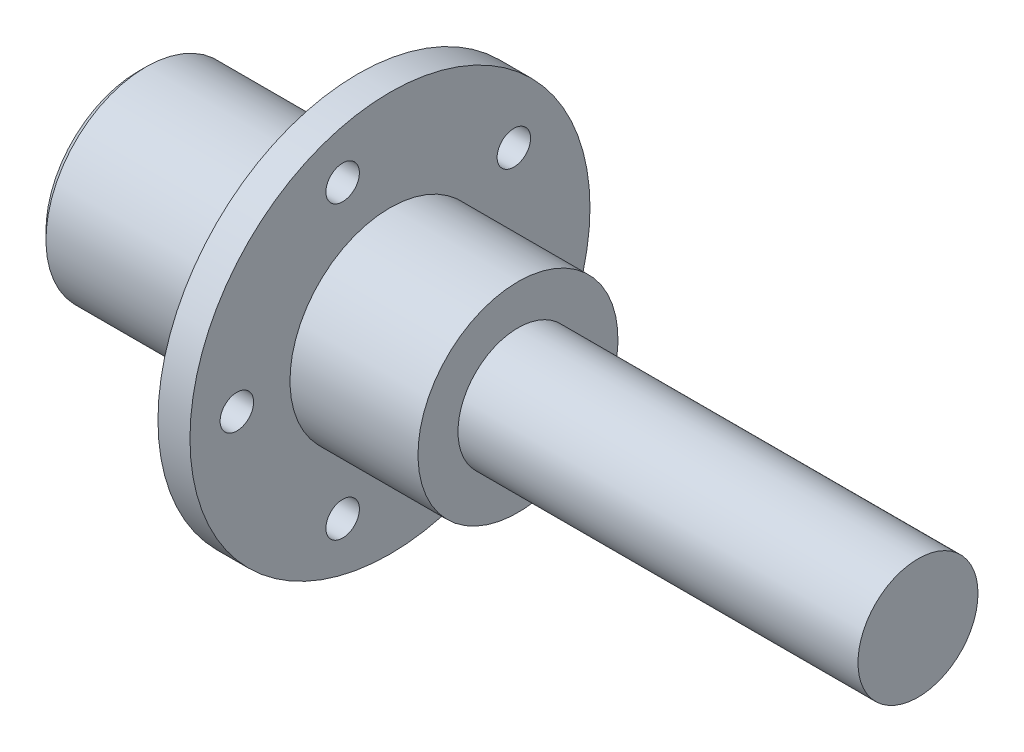
ISO-10303-21;
HEADER;
FILE_DESCRIPTION(('STEP AP214'),'2;1');
FILE_NAME('part.step','',(''),(''),'','','');
FILE_SCHEMA(('AUTOMOTIVE_DESIGN { 1 0 10303 214 1 1 1 1 }'));
ENDSEC;
DATA;
#1=APPLICATION_CONTEXT('core data for automotive mechanical design processes');
#2=APPLICATION_PROTOCOL_DEFINITION('international standard','automotive_design',2000,#1);
#3=PRODUCT_CONTEXT('',#1,'mechanical');
#4=PRODUCT('Part','Part','',(#3));
#5=PRODUCT_RELATED_PRODUCT_CATEGORY('part','',(#4));
#6=PRODUCT_DEFINITION_FORMATION('','',#4);
#7=PRODUCT_DEFINITION_CONTEXT('part definition',#1,'design');
#8=PRODUCT_DEFINITION('design','',#6,#7);
#9=PRODUCT_DEFINITION_SHAPE('','',#8);
#10=(LENGTH_UNIT() NAMED_UNIT(*) SI_UNIT(.MILLI.,.METRE.));
#11=(NAMED_UNIT(*) PLANE_ANGLE_UNIT() SI_UNIT($,.RADIAN.));
#12=(NAMED_UNIT(*) SI_UNIT($,.STERADIAN.) SOLID_ANGLE_UNIT());
#13=UNCERTAINTY_MEASURE_WITH_UNIT(LENGTH_MEASURE(1.E-05),#10,'distance_accuracy_value','');
#14=(GEOMETRIC_REPRESENTATION_CONTEXT(3) GLOBAL_UNCERTAINTY_ASSIGNED_CONTEXT((#13)) GLOBAL_UNIT_ASSIGNED_CONTEXT((#10,
#11,#12)) REPRESENTATION_CONTEXT('',''));
#15=CARTESIAN_POINT('',(0.,0.,0.));
#16=DIRECTION('',(0.,0.,1.));
#17=DIRECTION('',(1.,0.,0.));
#18=AXIS2_PLACEMENT_3D('',#15,#16,#17);
#19=CARTESIAN_POINT('',(8.,0.,0.));
#20=DIRECTION('',(1.,0.,0.));
#21=DIRECTION('',(0.,1.,0.));
#22=AXIS2_PLACEMENT_3D('',#19,#20,#21);
#23=PLANE('',#22);
#24=CARTESIAN_POINT('',(8.,0.,0.));
#25=DIRECTION('',(1.,0.,0.));
#26=DIRECTION('',(0.,-1.,0.));
#27=AXIS2_PLACEMENT_3D('',#24,#25,#26);
#28=CIRCLE('',#27,50.);
#29=CARTESIAN_POINT('',(8.,50.,0.));
#30=VERTEX_POINT('',#29);
#31=EDGE_CURVE('E29',#30,#30,#28,.T.);
#32=ORIENTED_EDGE('',*,*,#31,.T.);
#33=EDGE_LOOP('',(#32));
#34=FACE_BOUND('',#33,.T.);
#35=CARTESIAN_POINT('',(8.,0.,0.));
#36=DIRECTION('',(-1.,0.,0.));
#37=DIRECTION('',(0.,-1.,0.));
#38=AXIS2_PLACEMENT_3D('',#35,#36,#37);
#39=CIRCLE('',#38,25.);
#40=CARTESIAN_POINT('',(8.,25.,0.));
#41=VERTEX_POINT('',#40);
#42=EDGE_CURVE('E103',#41,#41,#39,.T.);
#43=ORIENTED_EDGE('',*,*,#42,.T.);
#44=EDGE_LOOP('',(#43));
#45=FACE_BOUND('',#44,.T.);
#46=CARTESIAN_POINT('',(8.,-36.4057647468726,11.8289500226805));
#47=DIRECTION('',(-1.,0.,0.));
#48=DIRECTION('',(0.,1.,0.));
#49=AXIS2_PLACEMENT_3D('',#46,#47,#48);
#50=CIRCLE('',#49,4.188);
#51=CARTESIAN_POINT('',(8.,-32.2177647468726,11.8289500226805));
#52=VERTEX_POINT('',#51);
#53=EDGE_CURVE('E123',#52,#52,#50,.T.);
#54=ORIENTED_EDGE('',*,*,#53,.T.);
#55=EDGE_LOOP('',(#54));
#56=FACE_BOUND('',#55,.T.);
#57=CARTESIAN_POINT('',(8.,36.4057647468726,11.8289500226805));
#58=DIRECTION('',(-1.,0.,0.));
#59=DIRECTION('',(0.,1.,0.));
#60=AXIS2_PLACEMENT_3D('',#57,#58,#59);
#61=CIRCLE('',#60,4.188);
#62=CARTESIAN_POINT('',(8.,40.5937647468726,11.8289500226805));
#63=VERTEX_POINT('',#62);
#64=EDGE_CURVE('E93',#63,#63,#61,.T.);
#65=ORIENTED_EDGE('',*,*,#64,.T.);
#66=EDGE_LOOP('',(#65));
#67=FACE_BOUND('',#66,.T.);
#68=CARTESIAN_POINT('',(8.,-22.5,-30.9685932106014));
#69=DIRECTION('',(-1.,0.,0.));
#70=DIRECTION('',(0.,1.,0.));
#71=AXIS2_PLACEMENT_3D('',#68,#69,#70);
#72=CIRCLE('',#71,4.188);
#73=CARTESIAN_POINT('',(8.,-18.312,-30.9685932106014));
#74=VERTEX_POINT('',#73);
#75=EDGE_CURVE('E108',#74,#74,#72,.T.);
#76=ORIENTED_EDGE('',*,*,#75,.T.);
#77=EDGE_LOOP('',(#76));
#78=FACE_BOUND('',#77,.T.);
#79=CARTESIAN_POINT('',(8.,22.5,-30.9685932106014));
#80=DIRECTION('',(-1.,0.,0.));
#81=DIRECTION('',(0.,1.,0.));
#82=AXIS2_PLACEMENT_3D('',#79,#80,#81);
#83=CIRCLE('',#82,4.188);
#84=CARTESIAN_POINT('',(8.,26.688,-30.9685932106014));
#85=VERTEX_POINT('',#84);
#86=EDGE_CURVE('E95',#85,#85,#83,.T.);
#87=ORIENTED_EDGE('',*,*,#86,.T.);
#88=EDGE_LOOP('',(#87));
#89=FACE_BOUND('',#88,.T.);
#90=CARTESIAN_POINT('',(8.,0.,38.2792863758418));
#91=DIRECTION('',(-1.,0.,0.));
#92=DIRECTION('',(0.,1.,0.));
#93=AXIS2_PLACEMENT_3D('',#90,#91,#92);
#94=CIRCLE('',#93,4.188);
#95=CARTESIAN_POINT('',(8.,4.188,38.2792863758418));
#96=VERTEX_POINT('',#95);
#97=EDGE_CURVE('E107',#96,#96,#94,.T.);
#98=ORIENTED_EDGE('',*,*,#97,.T.);
#99=EDGE_LOOP('',(#98));
#100=FACE_BOUND('',#99,.T.);
#101=ADVANCED_FACE('F18',(#34,#45,#56,#67,#78,#89,#100),#23,.T.);
#102=CARTESIAN_POINT('',(0.,0.,0.));
#103=DIRECTION('',(1.,0.,0.));
#104=DIRECTION('',(0.,1.,0.));
#105=AXIS2_PLACEMENT_3D('',#102,#103,#104);
#106=PLANE('',#105);
#107=CARTESIAN_POINT('',(0.,0.,0.));
#108=DIRECTION('',(-1.,0.,0.));
#109=DIRECTION('',(0.,-1.,0.));
#110=AXIS2_PLACEMENT_3D('',#107,#108,#109);
#111=CIRCLE('',#110,50.);
#112=CARTESIAN_POINT('',(0.,50.,0.));
#113=VERTEX_POINT('',#112);
#114=EDGE_CURVE('E11',#113,#113,#111,.T.);
#115=ORIENTED_EDGE('',*,*,#114,.T.);
#116=EDGE_LOOP('',(#115));
#117=FACE_BOUND('',#116,.T.);
#118=CARTESIAN_POINT('',(0.,0.,0.));
#119=DIRECTION('',(1.,0.,0.));
#120=DIRECTION('',(0.,-1.,0.));
#121=AXIS2_PLACEMENT_3D('',#118,#119,#120);
#122=CIRCLE('',#121,25.);
#123=CARTESIAN_POINT('',(0.,25.,0.));
#124=VERTEX_POINT('',#123);
#125=EDGE_CURVE('E77',#124,#124,#122,.T.);
#126=ORIENTED_EDGE('',*,*,#125,.T.);
#127=EDGE_LOOP('',(#126));
#128=FACE_BOUND('',#127,.T.);
#129=CARTESIAN_POINT('',(0.,-36.4057647468726,11.8289500226805));
#130=DIRECTION('',(1.,0.,0.));
#131=DIRECTION('',(0.,1.,0.));
#132=AXIS2_PLACEMENT_3D('',#129,#130,#131);
#133=CIRCLE('',#132,4.188);
#134=CARTESIAN_POINT('',(0.,-32.2177647468726,11.8289500226805));
#135=VERTEX_POINT('',#134);
#136=EDGE_CURVE('E126',#135,#135,#133,.T.);
#137=ORIENTED_EDGE('',*,*,#136,.T.);
#138=EDGE_LOOP('',(#137));
#139=FACE_BOUND('',#138,.T.);
#140=CARTESIAN_POINT('',(0.,36.4057647468726,11.8289500226805));
#141=DIRECTION('',(1.,0.,0.));
#142=DIRECTION('',(0.,1.,0.));
#143=AXIS2_PLACEMENT_3D('',#140,#141,#142);
#144=CIRCLE('',#143,4.188);
#145=CARTESIAN_POINT('',(0.,40.5937647468726,11.8289500226805));
#146=VERTEX_POINT('',#145);
#147=EDGE_CURVE('E111',#146,#146,#144,.T.);
#148=ORIENTED_EDGE('',*,*,#147,.T.);
#149=EDGE_LOOP('',(#148));
#150=FACE_BOUND('',#149,.T.);
#151=CARTESIAN_POINT('',(0.,-22.5,-30.9685932106014));
#152=DIRECTION('',(1.,0.,0.));
#153=DIRECTION('',(0.,1.,0.));
#154=AXIS2_PLACEMENT_3D('',#151,#152,#153);
#155=CIRCLE('',#154,4.188);
#156=CARTESIAN_POINT('',(0.,-18.312,-30.9685932106014));
#157=VERTEX_POINT('',#156);
#158=EDGE_CURVE('E98',#157,#157,#155,.T.);
#159=ORIENTED_EDGE('',*,*,#158,.T.);
#160=EDGE_LOOP('',(#159));
#161=FACE_BOUND('',#160,.T.);
#162=CARTESIAN_POINT('',(0.,22.5,-30.9685932106014));
#163=DIRECTION('',(1.,0.,0.));
#164=DIRECTION('',(0.,1.,0.));
#165=AXIS2_PLACEMENT_3D('',#162,#163,#164);
#166=CIRCLE('',#165,4.188);
#167=CARTESIAN_POINT('',(0.,26.688,-30.9685932106014));
#168=VERTEX_POINT('',#167);
#169=EDGE_CURVE('E99',#168,#168,#166,.T.);
#170=ORIENTED_EDGE('',*,*,#169,.T.);
#171=EDGE_LOOP('',(#170));
#172=FACE_BOUND('',#171,.T.);
#173=CARTESIAN_POINT('',(0.,0.,38.2792863758418));
#174=DIRECTION('',(1.,0.,0.));
#175=DIRECTION('',(0.,1.,0.));
#176=AXIS2_PLACEMENT_3D('',#173,#174,#175);
#177=CIRCLE('',#176,4.188);
#178=CARTESIAN_POINT('',(0.,4.188,38.2792863758418));
#179=VERTEX_POINT('',#178);
#180=EDGE_CURVE('E119',#179,#179,#177,.T.);
#181=ORIENTED_EDGE('',*,*,#180,.T.);
#182=EDGE_LOOP('',(#181));
#183=FACE_BOUND('',#182,.T.);
#184=ADVANCED_FACE('F78',(#117,#128,#139,#150,#161,#172,#183),#106,.F.);
#185=CARTESIAN_POINT('',(0.,0.,0.));
#186=DIRECTION('',(1.,0.,0.));
#187=DIRECTION('',(0.,-1.,0.));
#188=AXIS2_PLACEMENT_3D('',#185,#186,#187);
#189=CYLINDRICAL_SURFACE('',#188,50.);
#190=ORIENTED_EDGE('',*,*,#114,.F.);
#191=EDGE_LOOP('',(#190));
#192=FACE_BOUND('',#191,.T.);
#193=ORIENTED_EDGE('',*,*,#31,.F.);
#194=EDGE_LOOP('',(#193));
#195=FACE_BOUND('',#194,.T.);
#196=ADVANCED_FACE('F160',(#192,#195),#189,.T.);
#197=CARTESIAN_POINT('',(-55.,0.,0.));
#198=DIRECTION('',(1.,0.,0.));
#199=DIRECTION('',(0.,1.,0.));
#200=AXIS2_PLACEMENT_3D('',#197,#198,#199);
#201=PLANE('',#200);
#202=CARTESIAN_POINT('',(-55.,0.,0.));
#203=DIRECTION('',(1.,0.,0.));
#204=DIRECTION('',(0.,-1.,0.));
#205=AXIS2_PLACEMENT_3D('',#202,#203,#204);
#206=CIRCLE('',#205,23.);
#207=CARTESIAN_POINT('',(-55.,23.,0.));
#208=VERTEX_POINT('',#207);
#209=EDGE_CURVE('E82',#208,#208,#206,.T.);
#210=ORIENTED_EDGE('',*,*,#209,.F.);
#211=EDGE_LOOP('',(#210));
#212=FACE_BOUND('',#211,.T.);
#213=ADVANCED_FACE('F213',(#212),#201,.F.);
#214=CARTESIAN_POINT('',(0.,0.,0.));
#215=DIRECTION('',(-1.,0.,0.));
#216=DIRECTION('',(0.,-1.,0.));
#217=AXIS2_PLACEMENT_3D('',#214,#215,#216);
#218=CYLINDRICAL_SURFACE('',#217,25.);
#219=CARTESIAN_POINT('',(-53.,0.,0.));
#220=DIRECTION('',(-1.,0.,0.));
#221=DIRECTION('',(0.,-1.,0.));
#222=AXIS2_PLACEMENT_3D('',#219,#220,#221);
#223=CIRCLE('',#222,25.);
#224=CARTESIAN_POINT('',(-53.,25.,0.));
#225=VERTEX_POINT('',#224);
#226=EDGE_CURVE('E89',#225,#225,#223,.T.);
#227=ORIENTED_EDGE('',*,*,#226,.F.);
#228=EDGE_LOOP('',(#227));
#229=FACE_BOUND('',#228,.T.);
#230=ORIENTED_EDGE('',*,*,#125,.F.);
#231=EDGE_LOOP('',(#230));
#232=FACE_BOUND('',#231,.T.);
#233=ADVANCED_FACE('F215',(#229,#232),#218,.T.);
#234=CARTESIAN_POINT('',(-54.,0.,0.));
#235=DIRECTION('',(1.,0.,0.));
#236=DIRECTION('',(0.,-1.,0.));
#237=AXIS2_PLACEMENT_3D('',#234,#235,#236);
#238=CONICAL_SURFACE('',#237,24.,0.7853981634);
#239=ORIENTED_EDGE('',*,*,#209,.T.);
#240=EDGE_LOOP('',(#239));
#241=FACE_BOUND('',#240,.T.);
#242=ORIENTED_EDGE('',*,*,#226,.T.);
#243=EDGE_LOOP('',(#242));
#244=FACE_BOUND('',#243,.T.);
#245=ADVANCED_FACE('F174',(#241,#244),#238,.T.);
#246=CARTESIAN_POINT('',(40.,0.,0.));
#247=DIRECTION('',(1.,0.,0.));
#248=DIRECTION('',(0.,1.,0.));
#249=AXIS2_PLACEMENT_3D('',#246,#247,#248);
#250=PLANE('',#249);
#251=CARTESIAN_POINT('',(40.,0.,0.));
#252=DIRECTION('',(1.,0.,0.));
#253=DIRECTION('',(0.,-1.,0.));
#254=AXIS2_PLACEMENT_3D('',#251,#252,#253);
#255=CIRCLE('',#254,25.);
#256=CARTESIAN_POINT('',(40.,25.,0.));
#257=VERTEX_POINT('',#256);
#258=EDGE_CURVE('E122',#257,#257,#255,.T.);
#259=ORIENTED_EDGE('',*,*,#258,.T.);
#260=EDGE_LOOP('',(#259));
#261=FACE_BOUND('',#260,.T.);
#262=CARTESIAN_POINT('',(40.,0.,0.));
#263=DIRECTION('',(-1.,0.,0.));
#264=DIRECTION('',(0.,0.,1.));
#265=AXIS2_PLACEMENT_3D('',#262,#263,#264);
#266=CIRCLE('',#265,15.);
#267=CARTESIAN_POINT('',(40.,0.,-15.));
#268=VERTEX_POINT('',#267);
#269=EDGE_CURVE('E187',#268,#268,#266,.T.);
#270=ORIENTED_EDGE('',*,*,#269,.T.);
#271=EDGE_LOOP('',(#270));
#272=FACE_BOUND('',#271,.T.);
#273=ADVANCED_FACE('F163',(#261,#272),#250,.T.);
#274=CARTESIAN_POINT('',(0.,0.,0.));
#275=DIRECTION('',(1.,0.,0.));
#276=DIRECTION('',(0.,-1.,0.));
#277=AXIS2_PLACEMENT_3D('',#274,#275,#276);
#278=CYLINDRICAL_SURFACE('',#277,25.);
#279=ORIENTED_EDGE('',*,*,#42,.F.);
#280=EDGE_LOOP('',(#279));
#281=FACE_BOUND('',#280,.T.);
#282=ORIENTED_EDGE('',*,*,#258,.F.);
#283=EDGE_LOOP('',(#282));
#284=FACE_BOUND('',#283,.T.);
#285=ADVANCED_FACE('F165',(#281,#284),#278,.T.);
#286=CARTESIAN_POINT('',(4.,-36.4057647468726,11.8289500226805));
#287=DIRECTION('',(1.,0.,0.));
#288=DIRECTION('',(0.,1.,0.));
#289=AXIS2_PLACEMENT_3D('',#286,#287,#288);
#290=CYLINDRICAL_SURFACE('',#289,4.188);
#291=ORIENTED_EDGE('',*,*,#53,.F.);
#292=EDGE_LOOP('',(#291));
#293=FACE_BOUND('',#292,.T.);
#294=ORIENTED_EDGE('',*,*,#136,.F.);
#295=EDGE_LOOP('',(#294));
#296=FACE_BOUND('',#295,.T.);
#297=ADVANCED_FACE('F149',(#293,#296),#290,.F.);
#298=CARTESIAN_POINT('',(4.,36.4057647468726,11.8289500226805));
#299=DIRECTION('',(1.,0.,0.));
#300=DIRECTION('',(0.,1.,0.));
#301=AXIS2_PLACEMENT_3D('',#298,#299,#300);
#302=CYLINDRICAL_SURFACE('',#301,4.188);
#303=ORIENTED_EDGE('',*,*,#64,.F.);
#304=EDGE_LOOP('',(#303));
#305=FACE_BOUND('',#304,.T.);
#306=ORIENTED_EDGE('',*,*,#147,.F.);
#307=EDGE_LOOP('',(#306));
#308=FACE_BOUND('',#307,.T.);
#309=ADVANCED_FACE('F20',(#305,#308),#302,.F.);
#310=CARTESIAN_POINT('',(4.,-22.5,-30.9685932106014));
#311=DIRECTION('',(1.,0.,0.));
#312=DIRECTION('',(0.,1.,0.));
#313=AXIS2_PLACEMENT_3D('',#310,#311,#312);
#314=CYLINDRICAL_SURFACE('',#313,4.188);
#315=ORIENTED_EDGE('',*,*,#75,.F.);
#316=EDGE_LOOP('',(#315));
#317=FACE_BOUND('',#316,.T.);
#318=ORIENTED_EDGE('',*,*,#158,.F.);
#319=EDGE_LOOP('',(#318));
#320=FACE_BOUND('',#319,.T.);
#321=ADVANCED_FACE('F136',(#317,#320),#314,.F.);
#322=CARTESIAN_POINT('',(4.,22.5,-30.9685932106014));
#323=DIRECTION('',(1.,0.,0.));
#324=DIRECTION('',(0.,1.,0.));
#325=AXIS2_PLACEMENT_3D('',#322,#323,#324);
#326=CYLINDRICAL_SURFACE('',#325,4.188);
#327=ORIENTED_EDGE('',*,*,#86,.F.);
#328=EDGE_LOOP('',(#327));
#329=FACE_BOUND('',#328,.T.);
#330=ORIENTED_EDGE('',*,*,#169,.F.);
#331=EDGE_LOOP('',(#330));
#332=FACE_BOUND('',#331,.T.);
#333=ADVANCED_FACE('F138',(#329,#332),#326,.F.);
#334=CARTESIAN_POINT('',(4.,0.,38.2792863758418));
#335=DIRECTION('',(1.,0.,0.));
#336=DIRECTION('',(0.,1.,0.));
#337=AXIS2_PLACEMENT_3D('',#334,#335,#336);
#338=CYLINDRICAL_SURFACE('',#337,4.188);
#339=ORIENTED_EDGE('',*,*,#97,.F.);
#340=EDGE_LOOP('',(#339));
#341=FACE_BOUND('',#340,.T.);
#342=ORIENTED_EDGE('',*,*,#180,.F.);
#343=EDGE_LOOP('',(#342));
#344=FACE_BOUND('',#343,.T.);
#345=ADVANCED_FACE('F146',(#341,#344),#338,.F.);
#346=CARTESIAN_POINT('',(140.,0.,0.));
#347=DIRECTION('',(1.,0.,0.));
#348=DIRECTION('',(0.,1.,0.));
#349=AXIS2_PLACEMENT_3D('',#346,#347,#348);
#350=PLANE('',#349);
#351=CARTESIAN_POINT('',(140.,0.,0.));
#352=DIRECTION('',(1.,0.,0.));
#353=DIRECTION('',(0.,0.,1.));
#354=AXIS2_PLACEMENT_3D('',#351,#352,#353);
#355=CIRCLE('',#354,15.);
#356=CARTESIAN_POINT('',(140.,0.,-15.));
#357=VERTEX_POINT('',#356);
#358=EDGE_CURVE('E22',#357,#357,#355,.T.);
#359=ORIENTED_EDGE('',*,*,#358,.T.);
#360=EDGE_LOOP('',(#359));
#361=FACE_BOUND('',#360,.T.);
#362=ADVANCED_FACE('F203',(#361),#350,.T.);
#363=CARTESIAN_POINT('',(40.,0.,0.));
#364=DIRECTION('',(1.,0.,0.));
#365=DIRECTION('',(0.,0.,1.));
#366=AXIS2_PLACEMENT_3D('',#363,#364,#365);
#367=CYLINDRICAL_SURFACE('',#366,15.);
#368=ORIENTED_EDGE('',*,*,#269,.F.);
#369=EDGE_LOOP('',(#368));
#370=FACE_BOUND('',#369,.T.);
#371=ORIENTED_EDGE('',*,*,#358,.F.);
#372=EDGE_LOOP('',(#371));
#373=FACE_BOUND('',#372,.T.);
#374=ADVANCED_FACE('F209',(#370,#373),#367,.T.);
#375=CLOSED_SHELL('',(#101,#184,#196,#213,#233,#245,#273,#285,#297,#309,#321,#333,#345,#362,#374));
#376=MANIFOLD_SOLID_BREP('B1',#375);
#377=ADVANCED_BREP_SHAPE_REPRESENTATION('',(#18,#376),#14);
#378=SHAPE_DEFINITION_REPRESENTATION(#9,#377);
ENDSEC;
END-ISO-10303-21;
